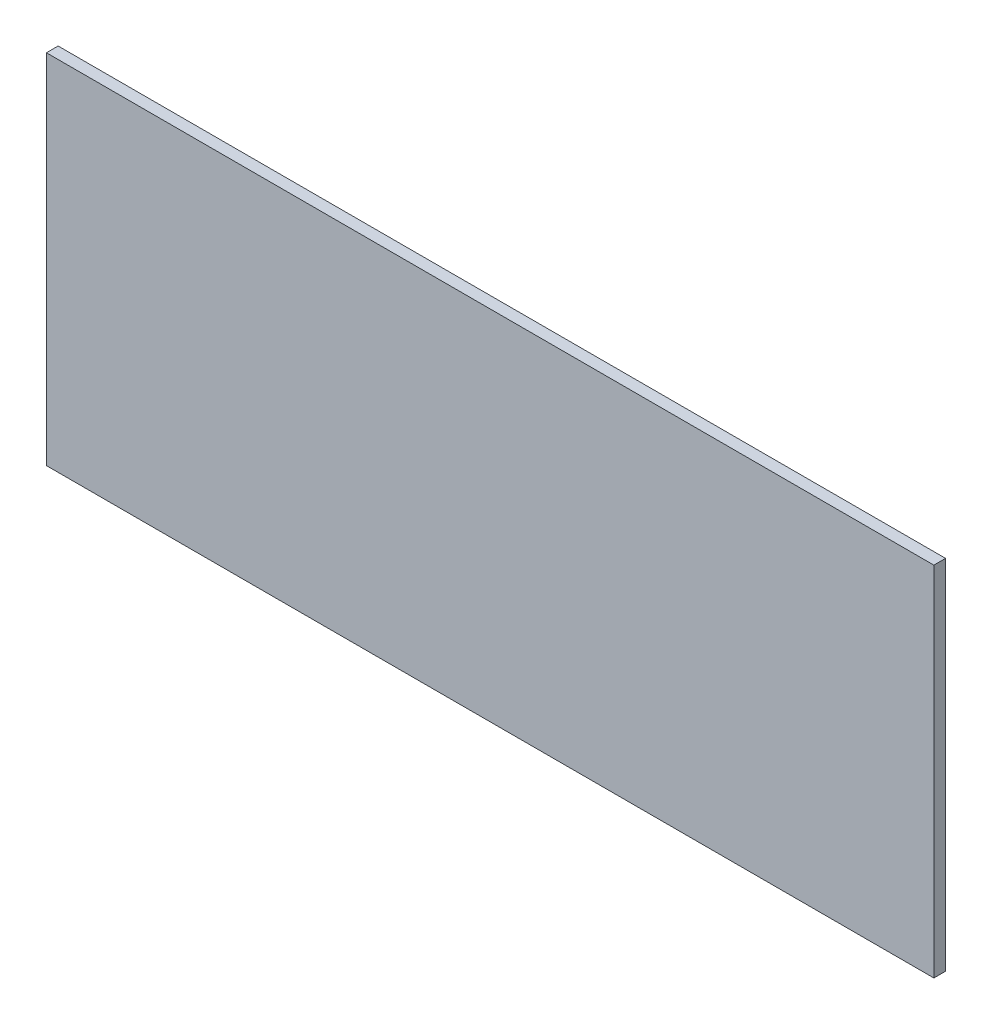
ISO-10303-21;
HEADER;
FILE_DESCRIPTION(('STEP AP214'),'2;1');
FILE_NAME('part.step','',(''),(''),'','','');
FILE_SCHEMA(('AUTOMOTIVE_DESIGN { 1 0 10303 214 1 1 1 1 }'));
ENDSEC;
DATA;
#1=APPLICATION_CONTEXT('core data for automotive mechanical design processes');
#2=APPLICATION_PROTOCOL_DEFINITION('international standard','automotive_design',2000,#1);
#3=PRODUCT_CONTEXT('',#1,'mechanical');
#4=PRODUCT('Part','Part','',(#3));
#5=PRODUCT_RELATED_PRODUCT_CATEGORY('part','',(#4));
#6=PRODUCT_DEFINITION_FORMATION('','',#4);
#7=PRODUCT_DEFINITION_CONTEXT('part definition',#1,'design');
#8=PRODUCT_DEFINITION('design','',#6,#7);
#9=PRODUCT_DEFINITION_SHAPE('','',#8);
#10=(LENGTH_UNIT() NAMED_UNIT(*) SI_UNIT(.MILLI.,.METRE.));
#11=(NAMED_UNIT(*) PLANE_ANGLE_UNIT() SI_UNIT($,.RADIAN.));
#12=(NAMED_UNIT(*) SI_UNIT($,.STERADIAN.) SOLID_ANGLE_UNIT());
#13=UNCERTAINTY_MEASURE_WITH_UNIT(LENGTH_MEASURE(1.E-05),#10,'distance_accuracy_value','');
#14=(GEOMETRIC_REPRESENTATION_CONTEXT(3) GLOBAL_UNCERTAINTY_ASSIGNED_CONTEXT((#13)) GLOBAL_UNIT_ASSIGNED_CONTEXT((#10,
#11,#12)) REPRESENTATION_CONTEXT('',''));
#15=CARTESIAN_POINT('',(0.,0.,0.));
#16=DIRECTION('',(0.,0.,1.));
#17=DIRECTION('',(1.,0.,0.));
#18=AXIS2_PLACEMENT_3D('',#15,#16,#17);
#19=CARTESIAN_POINT('',(-682.5,-275.,18.));
#20=DIRECTION('',(1.,0.,0.));
#21=DIRECTION('',(0.,0.,-1.));
#22=AXIS2_PLACEMENT_3D('',#19,#20,#21);
#23=PLANE('',#22);
#24=DIRECTION('',(0.,-1.,0.));
#25=VECTOR('',#24,1.);
#26=CARTESIAN_POINT('',(-682.5,-275.,0.));
#27=LINE('',#26,#25);
#28=CARTESIAN_POINT('',(-682.5,275.,0.));
#29=VERTEX_POINT('',#28);
#30=CARTESIAN_POINT('',(-682.5,-275.,0.));
#31=VERTEX_POINT('',#30);
#32=EDGE_CURVE('E96',#29,#31,#27,.T.);
#33=ORIENTED_EDGE('',*,*,#32,.T.);
#34=DIRECTION('',(0.,0.,-1.));
#35=VECTOR('',#34,1.);
#36=CARTESIAN_POINT('',(-682.5,-275.,18.));
#37=LINE('',#36,#35);
#38=CARTESIAN_POINT('',(-682.5,-275.,18.));
#39=VERTEX_POINT('',#38);
#40=EDGE_CURVE('E11',#39,#31,#37,.T.);
#41=ORIENTED_EDGE('',*,*,#40,.F.);
#42=DIRECTION('',(0.,-1.,0.));
#43=VECTOR('',#42,1.);
#44=CARTESIAN_POINT('',(-682.5,-275.,18.));
#45=LINE('',#44,#43);
#46=CARTESIAN_POINT('',(-682.5,275.,18.));
#47=VERTEX_POINT('',#46);
#48=EDGE_CURVE('E84',#47,#39,#45,.T.);
#49=ORIENTED_EDGE('',*,*,#48,.F.);
#50=DIRECTION('',(0.,0.,-1.));
#51=VECTOR('',#50,1.);
#52=CARTESIAN_POINT('',(-682.5,275.,18.));
#53=LINE('',#52,#51);
#54=EDGE_CURVE('E92',#47,#29,#53,.T.);
#55=ORIENTED_EDGE('',*,*,#54,.T.);
#56=EDGE_LOOP('',(#33,#41,#49,#55));
#57=FACE_BOUND('',#56,.T.);
#58=ADVANCED_FACE('F33',(#57),#23,.F.);
#59=CARTESIAN_POINT('',(682.5,-275.,18.));
#60=DIRECTION('',(0.,1.,0.));
#61=DIRECTION('',(-1.,0.,0.));
#62=AXIS2_PLACEMENT_3D('',#59,#60,#61);
#63=PLANE('',#62);
#64=DIRECTION('',(1.,0.,0.));
#65=VECTOR('',#64,1.);
#66=CARTESIAN_POINT('',(682.5,-275.,0.));
#67=LINE('',#66,#65);
#68=CARTESIAN_POINT('',(682.5,-275.,0.));
#69=VERTEX_POINT('',#68);
#70=EDGE_CURVE('E88',#31,#69,#67,.T.);
#71=ORIENTED_EDGE('',*,*,#70,.T.);
#72=DIRECTION('',(0.,0.,-1.));
#73=VECTOR('',#72,1.);
#74=CARTESIAN_POINT('',(682.5,-275.,18.));
#75=LINE('',#74,#73);
#76=CARTESIAN_POINT('',(682.5,-275.,18.));
#77=VERTEX_POINT('',#76);
#78=EDGE_CURVE('E41',#77,#69,#75,.T.);
#79=ORIENTED_EDGE('',*,*,#78,.F.);
#80=DIRECTION('',(1.,0.,0.));
#81=VECTOR('',#80,1.);
#82=CARTESIAN_POINT('',(682.5,-275.,18.));
#83=LINE('',#82,#81);
#84=EDGE_CURVE('E79',#39,#77,#83,.T.);
#85=ORIENTED_EDGE('',*,*,#84,.F.);
#86=ORIENTED_EDGE('',*,*,#40,.T.);
#87=EDGE_LOOP('',(#71,#79,#85,#86));
#88=FACE_BOUND('',#87,.T.);
#89=ADVANCED_FACE('F87',(#88),#63,.F.);
#90=CARTESIAN_POINT('',(682.5,-275.,18.));
#91=DIRECTION('',(-1.,0.,0.));
#92=DIRECTION('',(0.,0.,1.));
#93=AXIS2_PLACEMENT_3D('',#90,#91,#92);
#94=PLANE('',#93);
#95=DIRECTION('',(0.,1.,0.));
#96=VECTOR('',#95,1.);
#97=CARTESIAN_POINT('',(682.5,-275.,0.));
#98=LINE('',#97,#96);
#99=CARTESIAN_POINT('',(682.5,275.,0.));
#100=VERTEX_POINT('',#99);
#101=EDGE_CURVE('E66',#69,#100,#98,.T.);
#102=ORIENTED_EDGE('',*,*,#101,.T.);
#103=DIRECTION('',(0.,0.,-1.));
#104=VECTOR('',#103,1.);
#105=CARTESIAN_POINT('',(682.5,275.,18.));
#106=LINE('',#105,#104);
#107=CARTESIAN_POINT('',(682.5,275.,18.));
#108=VERTEX_POINT('',#107);
#109=EDGE_CURVE('E89',#108,#100,#106,.T.);
#110=ORIENTED_EDGE('',*,*,#109,.F.);
#111=DIRECTION('',(0.,1.,0.));
#112=VECTOR('',#111,1.);
#113=CARTESIAN_POINT('',(682.5,-275.,18.));
#114=LINE('',#113,#112);
#115=EDGE_CURVE('E82',#77,#108,#114,.T.);
#116=ORIENTED_EDGE('',*,*,#115,.F.);
#117=ORIENTED_EDGE('',*,*,#78,.T.);
#118=EDGE_LOOP('',(#102,#110,#116,#117));
#119=FACE_BOUND('',#118,.T.);
#120=ADVANCED_FACE('F90',(#119),#94,.F.);
#121=CARTESIAN_POINT('',(682.5,275.,18.));
#122=DIRECTION('',(0.,-1.,0.));
#123=DIRECTION('',(1.,0.,0.));
#124=AXIS2_PLACEMENT_3D('',#121,#122,#123);
#125=PLANE('',#124);
#126=DIRECTION('',(-1.,0.,0.));
#127=VECTOR('',#126,1.);
#128=CARTESIAN_POINT('',(682.5,275.,0.));
#129=LINE('',#128,#127);
#130=EDGE_CURVE('E72',#100,#29,#129,.T.);
#131=ORIENTED_EDGE('',*,*,#130,.T.);
#132=ORIENTED_EDGE('',*,*,#54,.F.);
#133=DIRECTION('',(-1.,0.,0.));
#134=VECTOR('',#133,1.);
#135=CARTESIAN_POINT('',(682.5,275.,18.));
#136=LINE('',#135,#134);
#137=EDGE_CURVE('E49',#108,#47,#136,.T.);
#138=ORIENTED_EDGE('',*,*,#137,.F.);
#139=ORIENTED_EDGE('',*,*,#109,.T.);
#140=EDGE_LOOP('',(#131,#132,#138,#139));
#141=FACE_BOUND('',#140,.T.);
#142=ADVANCED_FACE('F103',(#141),#125,.F.);
#143=CARTESIAN_POINT('',(0.,0.,18.));
#144=DIRECTION('',(0.,0.,1.));
#145=DIRECTION('',(1.,0.,0.));
#146=AXIS2_PLACEMENT_3D('',#143,#144,#145);
#147=PLANE('',#146);
#148=ORIENTED_EDGE('',*,*,#48,.T.);
#149=ORIENTED_EDGE('',*,*,#84,.T.);
#150=ORIENTED_EDGE('',*,*,#115,.T.);
#151=ORIENTED_EDGE('',*,*,#137,.T.);
#152=EDGE_LOOP('',(#148,#149,#150,#151));
#153=FACE_BOUND('',#152,.T.);
#154=ADVANCED_FACE('F80',(#153),#147,.T.);
#155=CARTESIAN_POINT('',(0.,0.,0.));
#156=DIRECTION('',(0.,0.,1.));
#157=DIRECTION('',(1.,0.,0.));
#158=AXIS2_PLACEMENT_3D('',#155,#156,#157);
#159=PLANE('',#158);
#160=ORIENTED_EDGE('',*,*,#32,.F.);
#161=ORIENTED_EDGE('',*,*,#130,.F.);
#162=ORIENTED_EDGE('',*,*,#101,.F.);
#163=ORIENTED_EDGE('',*,*,#70,.F.);
#164=EDGE_LOOP('',(#160,#161,#162,#163));
#165=FACE_BOUND('',#164,.T.);
#166=ADVANCED_FACE('F106',(#165),#159,.F.);
#167=CLOSED_SHELL('',(#58,#89,#120,#142,#154,#166));
#168=MANIFOLD_SOLID_BREP('B2',#167);
#169=ADVANCED_BREP_SHAPE_REPRESENTATION('',(#18,#168),#14);
#170=SHAPE_DEFINITION_REPRESENTATION(#9,#169);
ENDSEC;
END-ISO-10303-21;
